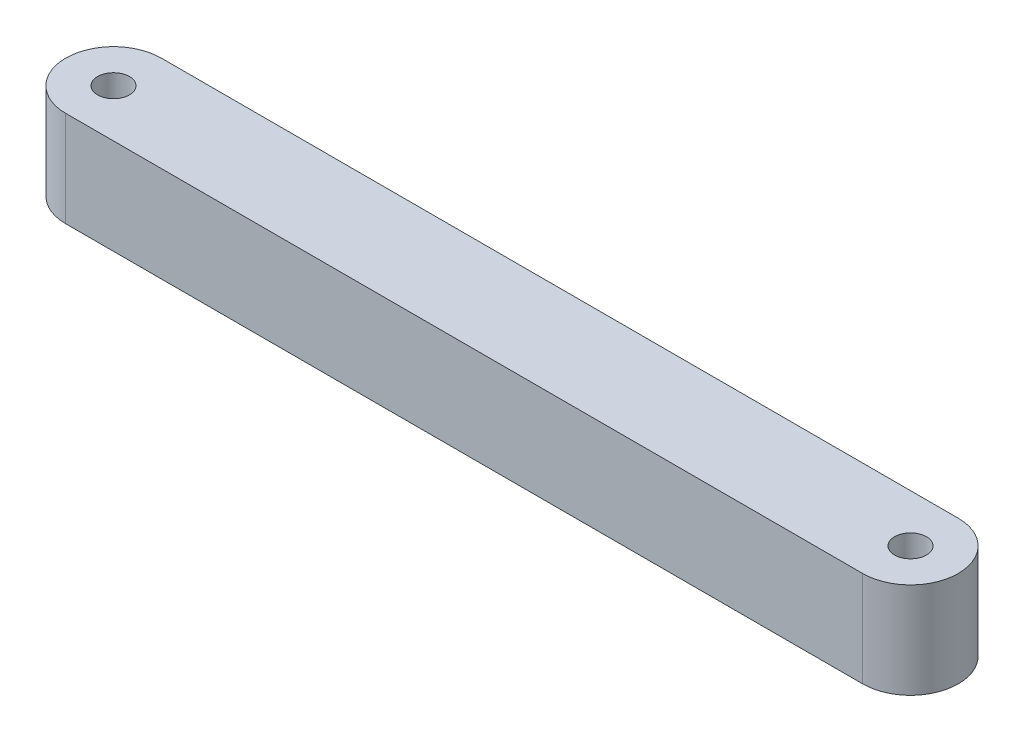
ISO-10303-21;
HEADER;
FILE_DESCRIPTION(('STEP AP214'),'2;1');
FILE_NAME('part.step','',(''),(''),'','','');
FILE_SCHEMA(('AUTOMOTIVE_DESIGN { 1 0 10303 214 1 1 1 1 }'));
ENDSEC;
DATA;
#1=APPLICATION_CONTEXT('core data for automotive mechanical design processes');
#2=APPLICATION_PROTOCOL_DEFINITION('international standard','automotive_design',2000,#1);
#3=PRODUCT_CONTEXT('',#1,'mechanical');
#4=PRODUCT('Part','Part','',(#3));
#5=PRODUCT_RELATED_PRODUCT_CATEGORY('part','',(#4));
#6=PRODUCT_DEFINITION_FORMATION('','',#4);
#7=PRODUCT_DEFINITION_CONTEXT('part definition',#1,'design');
#8=PRODUCT_DEFINITION('design','',#6,#7);
#9=PRODUCT_DEFINITION_SHAPE('','',#8);
#10=(LENGTH_UNIT() NAMED_UNIT(*) SI_UNIT(.MILLI.,.METRE.));
#11=(NAMED_UNIT(*) PLANE_ANGLE_UNIT() SI_UNIT($,.RADIAN.));
#12=(NAMED_UNIT(*) SI_UNIT($,.STERADIAN.) SOLID_ANGLE_UNIT());
#13=UNCERTAINTY_MEASURE_WITH_UNIT(LENGTH_MEASURE(1.E-05),#10,'distance_accuracy_value','');
#14=(GEOMETRIC_REPRESENTATION_CONTEXT(3) GLOBAL_UNCERTAINTY_ASSIGNED_CONTEXT((#13)) GLOBAL_UNIT_ASSIGNED_CONTEXT((#10,
#11,#12)) REPRESENTATION_CONTEXT('',''));
#15=CARTESIAN_POINT('',(0.,0.,0.));
#16=DIRECTION('',(0.,0.,1.));
#17=DIRECTION('',(1.,0.,0.));
#18=AXIS2_PLACEMENT_3D('',#15,#16,#17);
#19=CARTESIAN_POINT('',(-79.375,19.05,0.));
#20=DIRECTION('',(0.,1.,0.));
#21=DIRECTION('',(0.,0.,1.));
#22=AXIS2_PLACEMENT_3D('',#19,#20,#21);
#23=PLANE('',#22);
#24=CARTESIAN_POINT('',(-79.375,19.05,0.));
#25=DIRECTION('',(0.,1.,0.));
#26=DIRECTION('',(0.,0.,1.));
#27=AXIS2_PLACEMENT_3D('',#24,#25,#26);
#28=CIRCLE('',#27,3.175);
#29=CARTESIAN_POINT('',(-79.375,19.05,3.175));
#30=VERTEX_POINT('',#29);
#31=EDGE_CURVE('E102',#30,#30,#28,.T.);
#32=ORIENTED_EDGE('',*,*,#31,.F.);
#33=EDGE_LOOP('',(#32));
#34=FACE_BOUND('',#33,.T.);
#35=CARTESIAN_POINT('',(-79.375,19.05,0.));
#36=DIRECTION('',(0.,1.,0.));
#37=DIRECTION('',(0.,0.,1.));
#38=AXIS2_PLACEMENT_3D('',#35,#36,#37);
#39=CIRCLE('',#38,9.525);
#40=CARTESIAN_POINT('',(-79.375,19.05,-9.525));
#41=VERTEX_POINT('',#40);
#42=CARTESIAN_POINT('',(-79.375,19.05,9.525));
#43=VERTEX_POINT('',#42);
#44=EDGE_CURVE('E87',#41,#43,#39,.T.);
#45=ORIENTED_EDGE('',*,*,#44,.T.);
#46=DIRECTION('',(1.,0.,0.));
#47=VECTOR('',#46,1.);
#48=CARTESIAN_POINT('',(-79.375,19.05,9.525));
#49=LINE('',#48,#47);
#50=CARTESIAN_POINT('',(79.375,19.05,9.525));
#51=VERTEX_POINT('',#50);
#52=EDGE_CURVE('E82',#43,#51,#49,.T.);
#53=ORIENTED_EDGE('',*,*,#52,.T.);
#54=CARTESIAN_POINT('',(79.375,19.05,0.));
#55=DIRECTION('',(0.,1.,0.));
#56=DIRECTION('',(0.,0.,-1.));
#57=AXIS2_PLACEMENT_3D('',#54,#55,#56);
#58=CIRCLE('',#57,9.525);
#59=CARTESIAN_POINT('',(79.375,19.05,-9.525));
#60=VERTEX_POINT('',#59);
#61=EDGE_CURVE('E85',#51,#60,#58,.T.);
#62=ORIENTED_EDGE('',*,*,#61,.T.);
#63=DIRECTION('',(-1.,0.,0.));
#64=VECTOR('',#63,1.);
#65=CARTESIAN_POINT('',(-79.375,19.05,-9.525));
#66=LINE('',#65,#64);
#67=EDGE_CURVE('E52',#60,#41,#66,.T.);
#68=ORIENTED_EDGE('',*,*,#67,.T.);
#69=EDGE_LOOP('',(#45,#53,#62,#68));
#70=FACE_BOUND('',#69,.T.);
#71=CARTESIAN_POINT('',(79.375,19.05,0.));
#72=DIRECTION('',(0.,1.,0.));
#73=DIRECTION('',(0.,0.,1.));
#74=AXIS2_PLACEMENT_3D('',#71,#72,#73);
#75=CIRCLE('',#74,3.175);
#76=CARTESIAN_POINT('',(79.375,19.05,3.175));
#77=VERTEX_POINT('',#76);
#78=EDGE_CURVE('E117',#77,#77,#75,.T.);
#79=ORIENTED_EDGE('',*,*,#78,.F.);
#80=EDGE_LOOP('',(#79));
#81=FACE_BOUND('',#80,.T.);
#82=ADVANCED_FACE('F35',(#34,#70,#81),#23,.T.);
#83=CARTESIAN_POINT('',(-79.375,0.,0.));
#84=DIRECTION('',(0.,1.,0.));
#85=DIRECTION('',(0.,0.,1.));
#86=AXIS2_PLACEMENT_3D('',#83,#84,#85);
#87=PLANE('',#86);
#88=CARTESIAN_POINT('',(-79.375,0.,0.));
#89=DIRECTION('',(0.,1.,0.));
#90=DIRECTION('',(0.,0.,1.));
#91=AXIS2_PLACEMENT_3D('',#88,#89,#90);
#92=CIRCLE('',#91,9.525);
#93=CARTESIAN_POINT('',(-79.375,0.,-9.525));
#94=VERTEX_POINT('',#93);
#95=CARTESIAN_POINT('',(-79.375,0.,9.525));
#96=VERTEX_POINT('',#95);
#97=EDGE_CURVE('E99',#94,#96,#92,.T.);
#98=ORIENTED_EDGE('',*,*,#97,.F.);
#99=DIRECTION('',(-1.,0.,0.));
#100=VECTOR('',#99,1.);
#101=CARTESIAN_POINT('',(-79.375,0.,-9.525));
#102=LINE('',#101,#100);
#103=CARTESIAN_POINT('',(79.375,0.,-9.525));
#104=VERTEX_POINT('',#103);
#105=EDGE_CURVE('E75',#104,#94,#102,.T.);
#106=ORIENTED_EDGE('',*,*,#105,.F.);
#107=CARTESIAN_POINT('',(79.375,0.,0.));
#108=DIRECTION('',(0.,1.,0.));
#109=DIRECTION('',(0.,0.,-1.));
#110=AXIS2_PLACEMENT_3D('',#107,#108,#109);
#111=CIRCLE('',#110,9.525);
#112=CARTESIAN_POINT('',(79.375,0.,9.525));
#113=VERTEX_POINT('',#112);
#114=EDGE_CURVE('E69',#113,#104,#111,.T.);
#115=ORIENTED_EDGE('',*,*,#114,.F.);
#116=DIRECTION('',(1.,0.,0.));
#117=VECTOR('',#116,1.);
#118=CARTESIAN_POINT('',(-79.375,0.,9.525));
#119=LINE('',#118,#117);
#120=EDGE_CURVE('E91',#96,#113,#119,.T.);
#121=ORIENTED_EDGE('',*,*,#120,.F.);
#122=EDGE_LOOP('',(#98,#106,#115,#121));
#123=FACE_BOUND('',#122,.T.);
#124=CARTESIAN_POINT('',(-79.375,0.,0.));
#125=DIRECTION('',(0.,1.,0.));
#126=DIRECTION('',(0.,0.,1.));
#127=AXIS2_PLACEMENT_3D('',#124,#125,#126);
#128=CIRCLE('',#127,3.175);
#129=CARTESIAN_POINT('',(-79.375,0.,3.175));
#130=VERTEX_POINT('',#129);
#131=EDGE_CURVE('E114',#130,#130,#128,.T.);
#132=ORIENTED_EDGE('',*,*,#131,.T.);
#133=EDGE_LOOP('',(#132));
#134=FACE_BOUND('',#133,.T.);
#135=CARTESIAN_POINT('',(79.375,0.,0.));
#136=DIRECTION('',(0.,1.,0.));
#137=DIRECTION('',(0.,0.,1.));
#138=AXIS2_PLACEMENT_3D('',#135,#136,#137);
#139=CIRCLE('',#138,3.175);
#140=CARTESIAN_POINT('',(79.375,0.,3.175));
#141=VERTEX_POINT('',#140);
#142=EDGE_CURVE('E120',#141,#141,#139,.T.);
#143=ORIENTED_EDGE('',*,*,#142,.T.);
#144=EDGE_LOOP('',(#143));
#145=FACE_BOUND('',#144,.T.);
#146=ADVANCED_FACE('F110',(#123,#134,#145),#87,.F.);
#147=CARTESIAN_POINT('',(-79.375,19.05,0.));
#148=DIRECTION('',(0.,-1.,0.));
#149=DIRECTION('',(0.,0.,-1.));
#150=AXIS2_PLACEMENT_3D('',#147,#148,#149);
#151=CYLINDRICAL_SURFACE('',#150,9.525);
#152=ORIENTED_EDGE('',*,*,#97,.T.);
#153=DIRECTION('',(0.,-1.,0.));
#154=VECTOR('',#153,1.);
#155=CARTESIAN_POINT('',(-79.375,19.05,9.525));
#156=LINE('',#155,#154);
#157=EDGE_CURVE('E11',#43,#96,#156,.T.);
#158=ORIENTED_EDGE('',*,*,#157,.F.);
#159=ORIENTED_EDGE('',*,*,#44,.F.);
#160=DIRECTION('',(0.,-1.,0.));
#161=VECTOR('',#160,1.);
#162=CARTESIAN_POINT('',(-79.375,19.05,-9.525));
#163=LINE('',#162,#161);
#164=EDGE_CURVE('E95',#41,#94,#163,.T.);
#165=ORIENTED_EDGE('',*,*,#164,.T.);
#166=EDGE_LOOP('',(#152,#158,#159,#165));
#167=FACE_BOUND('',#166,.T.);
#168=ADVANCED_FACE('F37',(#167),#151,.T.);
#169=CARTESIAN_POINT('',(-79.375,19.05,9.525));
#170=DIRECTION('',(0.,0.,-1.));
#171=DIRECTION('',(-1.,0.,0.));
#172=AXIS2_PLACEMENT_3D('',#169,#170,#171);
#173=PLANE('',#172);
#174=ORIENTED_EDGE('',*,*,#120,.T.);
#175=DIRECTION('',(0.,-1.,0.));
#176=VECTOR('',#175,1.);
#177=CARTESIAN_POINT('',(79.375,19.05,9.525));
#178=LINE('',#177,#176);
#179=EDGE_CURVE('E44',#51,#113,#178,.T.);
#180=ORIENTED_EDGE('',*,*,#179,.F.);
#181=ORIENTED_EDGE('',*,*,#52,.F.);
#182=ORIENTED_EDGE('',*,*,#157,.T.);
#183=EDGE_LOOP('',(#174,#180,#181,#182));
#184=FACE_BOUND('',#183,.T.);
#185=ADVANCED_FACE('F90',(#184),#173,.F.);
#186=CARTESIAN_POINT('',(79.375,19.05,0.));
#187=DIRECTION('',(0.,-1.,0.));
#188=DIRECTION('',(0.,0.,-1.));
#189=AXIS2_PLACEMENT_3D('',#186,#187,#188);
#190=CYLINDRICAL_SURFACE('',#189,9.525);
#191=ORIENTED_EDGE('',*,*,#114,.T.);
#192=DIRECTION('',(0.,-1.,0.));
#193=VECTOR('',#192,1.);
#194=CARTESIAN_POINT('',(79.375,19.05,-9.525));
#195=LINE('',#194,#193);
#196=EDGE_CURVE('E92',#60,#104,#195,.T.);
#197=ORIENTED_EDGE('',*,*,#196,.F.);
#198=ORIENTED_EDGE('',*,*,#61,.F.);
#199=ORIENTED_EDGE('',*,*,#179,.T.);
#200=EDGE_LOOP('',(#191,#197,#198,#199));
#201=FACE_BOUND('',#200,.T.);
#202=ADVANCED_FACE('F93',(#201),#190,.T.);
#203=CARTESIAN_POINT('',(-79.375,19.05,-9.525));
#204=DIRECTION('',(0.,0.,1.));
#205=DIRECTION('',(1.,0.,0.));
#206=AXIS2_PLACEMENT_3D('',#203,#204,#205);
#207=PLANE('',#206);
#208=ORIENTED_EDGE('',*,*,#105,.T.);
#209=ORIENTED_EDGE('',*,*,#164,.F.);
#210=ORIENTED_EDGE('',*,*,#67,.F.);
#211=ORIENTED_EDGE('',*,*,#196,.T.);
#212=EDGE_LOOP('',(#208,#209,#210,#211));
#213=FACE_BOUND('',#212,.T.);
#214=ADVANCED_FACE('F107',(#213),#207,.F.);
#215=CARTESIAN_POINT('',(-79.375,19.05,0.));
#216=DIRECTION('',(0.,-1.,0.));
#217=DIRECTION('',(0.,0.,-1.));
#218=AXIS2_PLACEMENT_3D('',#215,#216,#217);
#219=CYLINDRICAL_SURFACE('',#218,3.175);
#220=ORIENTED_EDGE('',*,*,#31,.T.);
#221=EDGE_LOOP('',(#220));
#222=FACE_BOUND('',#221,.T.);
#223=ORIENTED_EDGE('',*,*,#131,.F.);
#224=EDGE_LOOP('',(#223));
#225=FACE_BOUND('',#224,.T.);
#226=ADVANCED_FACE('F137',(#222,#225),#219,.F.);
#227=CARTESIAN_POINT('',(79.375,19.05,0.));
#228=DIRECTION('',(0.,-1.,0.));
#229=DIRECTION('',(0.,0.,-1.));
#230=AXIS2_PLACEMENT_3D('',#227,#228,#229);
#231=CYLINDRICAL_SURFACE('',#230,3.175);
#232=ORIENTED_EDGE('',*,*,#78,.T.);
#233=EDGE_LOOP('',(#232));
#234=FACE_BOUND('',#233,.T.);
#235=ORIENTED_EDGE('',*,*,#142,.F.);
#236=EDGE_LOOP('',(#235));
#237=FACE_BOUND('',#236,.T.);
#238=ADVANCED_FACE('F126',(#234,#237),#231,.F.);
#239=CLOSED_SHELL('',(#82,#146,#168,#185,#202,#214,#226,#238));
#240=MANIFOLD_SOLID_BREP('B2',#239);
#241=ADVANCED_BREP_SHAPE_REPRESENTATION('',(#18,#240),#14);
#242=SHAPE_DEFINITION_REPRESENTATION(#9,#241);
ENDSEC;
END-ISO-10303-21;
